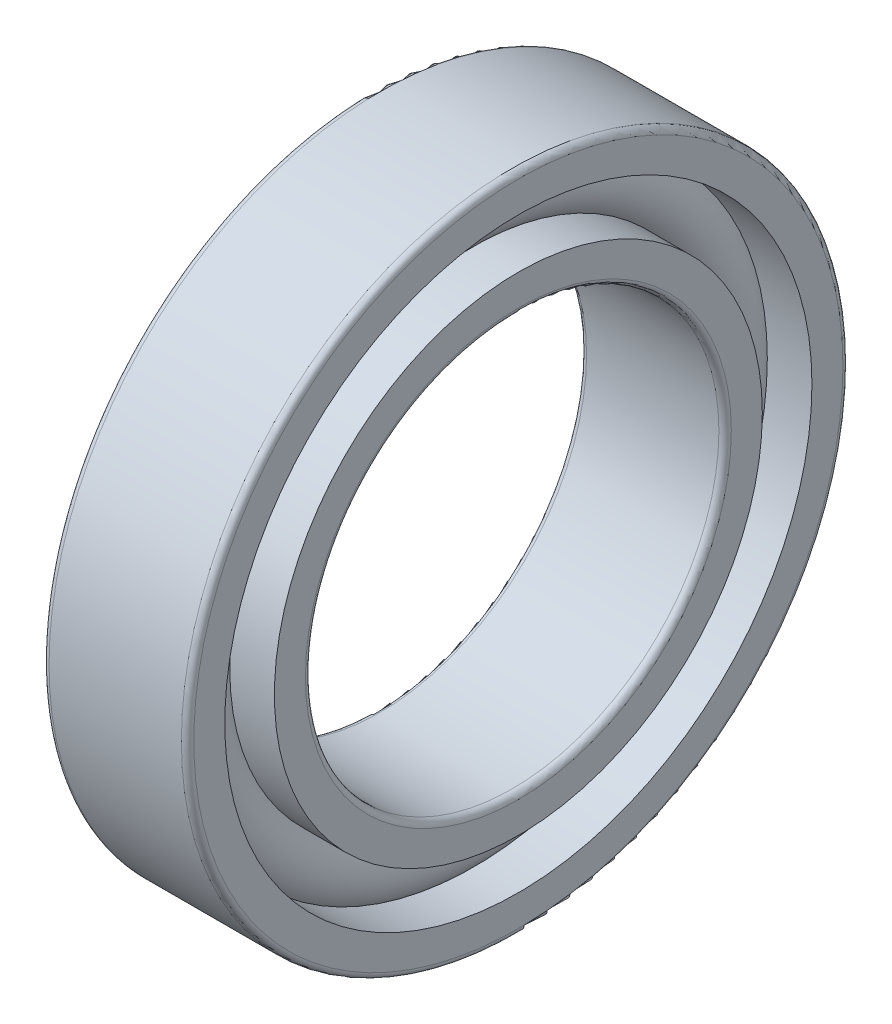
ISO-10303-21;
HEADER;
FILE_DESCRIPTION(('STEP AP214'),'2;1');
FILE_NAME('part.step','',(''),(''),'','','');
FILE_SCHEMA(('AUTOMOTIVE_DESIGN { 1 0 10303 214 1 1 1 1 }'));
ENDSEC;
DATA;
#1=APPLICATION_CONTEXT('core data for automotive mechanical design processes');
#2=APPLICATION_PROTOCOL_DEFINITION('international standard','automotive_design',2000,#1);
#3=PRODUCT_CONTEXT('',#1,'mechanical');
#4=PRODUCT('Part','Part','',(#3));
#5=PRODUCT_RELATED_PRODUCT_CATEGORY('part','',(#4));
#6=PRODUCT_DEFINITION_FORMATION('','',#4);
#7=PRODUCT_DEFINITION_CONTEXT('part definition',#1,'design');
#8=PRODUCT_DEFINITION('design','',#6,#7);
#9=PRODUCT_DEFINITION_SHAPE('','',#8);
#10=(LENGTH_UNIT() NAMED_UNIT(*) SI_UNIT(.MILLI.,.METRE.));
#11=(NAMED_UNIT(*) PLANE_ANGLE_UNIT() SI_UNIT($,.RADIAN.));
#12=(NAMED_UNIT(*) SI_UNIT($,.STERADIAN.) SOLID_ANGLE_UNIT());
#13=UNCERTAINTY_MEASURE_WITH_UNIT(LENGTH_MEASURE(1.E-05),#10,'distance_accuracy_value','');
#14=(GEOMETRIC_REPRESENTATION_CONTEXT(3) GLOBAL_UNCERTAINTY_ASSIGNED_CONTEXT((#13)) GLOBAL_UNIT_ASSIGNED_CONTEXT((#10,
#11,#12)) REPRESENTATION_CONTEXT('',''));
#15=CARTESIAN_POINT('',(0.,0.,0.));
#16=DIRECTION('',(0.,0.,1.));
#17=DIRECTION('',(1.,0.,0.));
#18=AXIS2_PLACEMENT_3D('',#15,#16,#17);
#19=CARTESIAN_POINT('',(0.,0.,0.));
#20=DIRECTION('',(-1.,0.,0.));
#21=DIRECTION('',(0.,0.,1.));
#22=AXIS2_PLACEMENT_3D('',#19,#20,#21);
#23=TOROIDAL_SURFACE('',#22,13.,1.8);
#24=CARTESIAN_POINT('',(1.34164078649987,0.,0.));
#25=DIRECTION('',(-1.,0.,0.));
#26=DIRECTION('',(0.,0.,1.));
#27=AXIS2_PLACEMENT_3D('',#24,#25,#26);
#28=CIRCLE('',#27,14.2);
#29=CARTESIAN_POINT('',(1.34164078649987,0.,14.2));
#30=VERTEX_POINT('',#29);
#31=EDGE_CURVE('E35',#30,#30,#28,.F.);
#32=ORIENTED_EDGE('',*,*,#31,.T.);
#33=EDGE_LOOP('',(#32));
#34=FACE_BOUND('',#33,.T.);
#35=CARTESIAN_POINT('',(1.34164078649987,0.,0.));
#36=DIRECTION('',(-1.,0.,0.));
#37=DIRECTION('',(0.,0.,1.));
#38=AXIS2_PLACEMENT_3D('',#35,#36,#37);
#39=CIRCLE('',#38,11.8);
#40=CARTESIAN_POINT('',(1.34164078649987,0.,11.8));
#41=VERTEX_POINT('',#40);
#42=EDGE_CURVE('E10',#41,#41,#39,.T.);
#43=ORIENTED_EDGE('',*,*,#42,.T.);
#44=EDGE_LOOP('',(#43));
#45=FACE_BOUND('',#44,.T.);
#46=ADVANCED_FACE('F31',(#34,#45),#23,.T.);
#47=CARTESIAN_POINT('',(-20.6375,0.,0.));
#48=DIRECTION('',(1.,0.,0.));
#49=DIRECTION('',(0.,0.,-1.));
#50=AXIS2_PLACEMENT_3D('',#47,#48,#49);
#51=CYLINDRICAL_SURFACE('',#50,11.8);
#52=CARTESIAN_POINT('',(3.5,0.,0.));
#53=DIRECTION('',(1.,0.,0.));
#54=DIRECTION('',(0.,0.,-1.));
#55=AXIS2_PLACEMENT_3D('',#52,#53,#54);
#56=CIRCLE('',#55,11.8);
#57=CARTESIAN_POINT('',(3.5,0.,-11.8));
#58=VERTEX_POINT('',#57);
#59=EDGE_CURVE('E44',#58,#58,#56,.T.);
#60=ORIENTED_EDGE('',*,*,#59,.F.);
#61=EDGE_LOOP('',(#60));
#62=FACE_BOUND('',#61,.T.);
#63=ORIENTED_EDGE('',*,*,#42,.F.);
#64=EDGE_LOOP('',(#63));
#65=FACE_BOUND('',#64,.T.);
#66=ADVANCED_FACE('F83',(#62,#65),#51,.T.);
#67=CARTESIAN_POINT('',(-20.6375,0.,0.));
#68=DIRECTION('',(1.,0.,0.));
#69=DIRECTION('',(0.,0.,-1.));
#70=AXIS2_PLACEMENT_3D('',#67,#68,#69);
#71=CYLINDRICAL_SURFACE('',#70,11.8);
#72=CARTESIAN_POINT('',(-3.5,0.,0.));
#73=DIRECTION('',(1.,0.,0.));
#74=DIRECTION('',(0.,0.,-1.));
#75=AXIS2_PLACEMENT_3D('',#72,#73,#74);
#76=CIRCLE('',#75,11.8);
#77=CARTESIAN_POINT('',(-3.5,0.,-11.8));
#78=VERTEX_POINT('',#77);
#79=EDGE_CURVE('E53',#78,#78,#76,.T.);
#80=ORIENTED_EDGE('',*,*,#79,.T.);
#81=EDGE_LOOP('',(#80));
#82=FACE_BOUND('',#81,.T.);
#83=CARTESIAN_POINT('',(-1.34164078649987,0.,0.));
#84=DIRECTION('',(1.,0.,0.));
#85=DIRECTION('',(0.,0.,-1.));
#86=AXIS2_PLACEMENT_3D('',#83,#84,#85);
#87=CIRCLE('',#86,11.8);
#88=CARTESIAN_POINT('',(-1.34164078649987,0.,-11.8));
#89=VERTEX_POINT('',#88);
#90=EDGE_CURVE('E39',#89,#89,#87,.T.);
#91=ORIENTED_EDGE('',*,*,#90,.F.);
#92=EDGE_LOOP('',(#91));
#93=FACE_BOUND('',#92,.T.);
#94=ADVANCED_FACE('F86',(#82,#93),#71,.T.);
#95=CARTESIAN_POINT('',(3.5,10.3,0.));
#96=DIRECTION('',(1.,0.,0.));
#97=DIRECTION('',(0.,0.,-1.));
#98=AXIS2_PLACEMENT_3D('',#95,#96,#97);
#99=PLANE('',#98);
#100=ORIENTED_EDGE('',*,*,#59,.T.);
#101=EDGE_LOOP('',(#100));
#102=FACE_BOUND('',#101,.T.);
#103=CARTESIAN_POINT('',(3.5,0.,0.));
#104=DIRECTION('',(1.,0.,0.));
#105=DIRECTION('',(0.,0.,-1.));
#106=AXIS2_PLACEMENT_3D('',#103,#104,#105);
#107=CIRCLE('',#106,10.3);
#108=CARTESIAN_POINT('',(3.5,0.,-10.3));
#109=VERTEX_POINT('',#108);
#110=EDGE_CURVE('E75',#109,#109,#107,.T.);
#111=ORIENTED_EDGE('',*,*,#110,.F.);
#112=EDGE_LOOP('',(#111));
#113=FACE_BOUND('',#112,.T.);
#114=ADVANCED_FACE('F80',(#102,#113),#99,.T.);
#115=CARTESIAN_POINT('',(3.2,0.,0.));
#116=DIRECTION('',(1.,0.,0.));
#117=DIRECTION('',(0.,0.,-1.));
#118=AXIS2_PLACEMENT_3D('',#115,#116,#117);
#119=TOROIDAL_SURFACE('',#118,10.3,0.300000000000002);
#120=ORIENTED_EDGE('',*,*,#110,.T.);
#121=EDGE_LOOP('',(#120));
#122=FACE_BOUND('',#121,.T.);
#123=CARTESIAN_POINT('',(3.2,0.,0.));
#124=DIRECTION('',(1.,0.,0.));
#125=DIRECTION('',(0.,0.,-1.));
#126=AXIS2_PLACEMENT_3D('',#123,#124,#125);
#127=CIRCLE('',#126,9.99999999999999);
#128=CARTESIAN_POINT('',(3.2,0.,-9.99999999999999));
#129=VERTEX_POINT('',#128);
#130=EDGE_CURVE('E72',#129,#129,#127,.T.);
#131=ORIENTED_EDGE('',*,*,#130,.F.);
#132=EDGE_LOOP('',(#131));
#133=FACE_BOUND('',#132,.T.);
#134=ADVANCED_FACE('F97',(#122,#133),#119,.T.);
#135=CARTESIAN_POINT('',(-20.6375,0.,0.));
#136=DIRECTION('',(1.,0.,0.));
#137=DIRECTION('',(0.,0.,-1.));
#138=AXIS2_PLACEMENT_3D('',#135,#136,#137);
#139=CYLINDRICAL_SURFACE('',#138,10.);
#140=ORIENTED_EDGE('',*,*,#130,.T.);
#141=EDGE_LOOP('',(#140));
#142=FACE_BOUND('',#141,.T.);
#143=CARTESIAN_POINT('',(-3.2,0.,0.));
#144=DIRECTION('',(1.,0.,0.));
#145=DIRECTION('',(0.,0.,-1.));
#146=AXIS2_PLACEMENT_3D('',#143,#144,#145);
#147=CIRCLE('',#146,10.);
#148=CARTESIAN_POINT('',(-3.2,0.,-10.));
#149=VERTEX_POINT('',#148);
#150=EDGE_CURVE('E69',#149,#149,#147,.T.);
#151=ORIENTED_EDGE('',*,*,#150,.F.);
#152=EDGE_LOOP('',(#151));
#153=FACE_BOUND('',#152,.T.);
#154=ADVANCED_FACE('F100',(#142,#153),#139,.F.);
#155=CARTESIAN_POINT('',(-3.2,0.,0.));
#156=DIRECTION('',(1.,0.,0.));
#157=DIRECTION('',(0.,0.,-1.));
#158=AXIS2_PLACEMENT_3D('',#155,#156,#157);
#159=TOROIDAL_SURFACE('',#158,10.3,0.300000000000002);
#160=ORIENTED_EDGE('',*,*,#150,.T.);
#161=EDGE_LOOP('',(#160));
#162=FACE_BOUND('',#161,.T.);
#163=CARTESIAN_POINT('',(-3.5,0.,0.));
#164=DIRECTION('',(1.,0.,0.));
#165=DIRECTION('',(0.,0.,-1.));
#166=AXIS2_PLACEMENT_3D('',#163,#164,#165);
#167=CIRCLE('',#166,10.3);
#168=CARTESIAN_POINT('',(-3.5,0.,-10.3));
#169=VERTEX_POINT('',#168);
#170=EDGE_CURVE('E66',#169,#169,#167,.T.);
#171=ORIENTED_EDGE('',*,*,#170,.F.);
#172=EDGE_LOOP('',(#171));
#173=FACE_BOUND('',#172,.T.);
#174=ADVANCED_FACE('F104',(#162,#173),#159,.T.);
#175=CARTESIAN_POINT('',(-3.5,11.8,0.));
#176=DIRECTION('',(-1.,0.,0.));
#177=DIRECTION('',(0.,0.,1.));
#178=AXIS2_PLACEMENT_3D('',#175,#176,#177);
#179=PLANE('',#178);
#180=ORIENTED_EDGE('',*,*,#170,.T.);
#181=EDGE_LOOP('',(#180));
#182=FACE_BOUND('',#181,.T.);
#183=ORIENTED_EDGE('',*,*,#79,.F.);
#184=EDGE_LOOP('',(#183));
#185=FACE_BOUND('',#184,.T.);
#186=ADVANCED_FACE('F108',(#182,#185),#179,.T.);
#187=CARTESIAN_POINT('',(-1.34164078649987,0.,0.));
#188=DIRECTION('',(1.,0.,0.));
#189=DIRECTION('',(0.,0.,-1.));
#190=AXIS2_PLACEMENT_3D('',#187,#188,#189);
#191=CIRCLE('',#190,14.2);
#192=CARTESIAN_POINT('',(-1.34164078649987,0.,-14.2));
#193=VERTEX_POINT('',#192);
#194=EDGE_CURVE('E47',#193,#193,#191,.F.);
#195=ORIENTED_EDGE('',*,*,#194,.T.);
#196=EDGE_LOOP('',(#195));
#197=FACE_BOUND('',#196,.T.);
#198=ORIENTED_EDGE('',*,*,#90,.T.);
#199=EDGE_LOOP('',(#198));
#200=FACE_BOUND('',#199,.T.);
#201=ADVANCED_FACE('F33',(#197,#200),#23,.T.);
#202=CARTESIAN_POINT('',(-20.6375,0.,0.));
#203=DIRECTION('',(1.,0.,0.));
#204=DIRECTION('',(0.,0.,-1.));
#205=AXIS2_PLACEMENT_3D('',#202,#203,#204);
#206=CYLINDRICAL_SURFACE('',#205,14.2);
#207=CARTESIAN_POINT('',(3.5,0.,0.));
#208=DIRECTION('',(1.,0.,0.));
#209=DIRECTION('',(0.,0.,-1.));
#210=AXIS2_PLACEMENT_3D('',#207,#208,#209);
#211=CIRCLE('',#210,14.2);
#212=CARTESIAN_POINT('',(3.5,0.,-14.2));
#213=VERTEX_POINT('',#212);
#214=EDGE_CURVE('E49',#213,#213,#211,.T.);
#215=ORIENTED_EDGE('',*,*,#214,.T.);
#216=EDGE_LOOP('',(#215));
#217=FACE_BOUND('',#216,.T.);
#218=ORIENTED_EDGE('',*,*,#31,.F.);
#219=EDGE_LOOP('',(#218));
#220=FACE_BOUND('',#219,.T.);
#221=ADVANCED_FACE('F113',(#217,#220),#206,.F.);
#222=CARTESIAN_POINT('',(-20.6375,0.,0.));
#223=DIRECTION('',(1.,0.,0.));
#224=DIRECTION('',(0.,0.,-1.));
#225=AXIS2_PLACEMENT_3D('',#222,#223,#224);
#226=CYLINDRICAL_SURFACE('',#225,14.2);
#227=CARTESIAN_POINT('',(-3.5,0.,0.));
#228=DIRECTION('',(1.,0.,0.));
#229=DIRECTION('',(0.,0.,-1.));
#230=AXIS2_PLACEMENT_3D('',#227,#228,#229);
#231=CIRCLE('',#230,14.2);
#232=CARTESIAN_POINT('',(-3.5,0.,-14.2));
#233=VERTEX_POINT('',#232);
#234=EDGE_CURVE('E144',#233,#233,#231,.T.);
#235=ORIENTED_EDGE('',*,*,#234,.F.);
#236=EDGE_LOOP('',(#235));
#237=FACE_BOUND('',#236,.T.);
#238=ORIENTED_EDGE('',*,*,#194,.F.);
#239=EDGE_LOOP('',(#238));
#240=FACE_BOUND('',#239,.T.);
#241=ADVANCED_FACE('F116',(#237,#240),#226,.F.);
#242=CARTESIAN_POINT('',(3.5,15.7,0.));
#243=DIRECTION('',(1.,0.,0.));
#244=DIRECTION('',(0.,0.,-1.));
#245=AXIS2_PLACEMENT_3D('',#242,#243,#244);
#246=PLANE('',#245);
#247=CARTESIAN_POINT('',(3.5,0.,0.));
#248=DIRECTION('',(1.,0.,0.));
#249=DIRECTION('',(0.,0.,-1.));
#250=AXIS2_PLACEMENT_3D('',#247,#248,#249);
#251=CIRCLE('',#250,15.7);
#252=CARTESIAN_POINT('',(3.5,0.,-15.7));
#253=VERTEX_POINT('',#252);
#254=EDGE_CURVE('E55',#253,#253,#251,.T.);
#255=ORIENTED_EDGE('',*,*,#254,.T.);
#256=EDGE_LOOP('',(#255));
#257=FACE_BOUND('',#256,.T.);
#258=ORIENTED_EDGE('',*,*,#214,.F.);
#259=EDGE_LOOP('',(#258));
#260=FACE_BOUND('',#259,.T.);
#261=ADVANCED_FACE('F117',(#257,#260),#246,.T.);
#262=CARTESIAN_POINT('',(3.2,0.,0.));
#263=DIRECTION('',(1.,0.,0.));
#264=DIRECTION('',(0.,0.,-1.));
#265=AXIS2_PLACEMENT_3D('',#262,#263,#264);
#266=TOROIDAL_SURFACE('',#265,15.7,0.300000000000001);
#267=CARTESIAN_POINT('',(3.2,0.,0.));
#268=DIRECTION('',(1.,0.,0.));
#269=DIRECTION('',(0.,0.,-1.));
#270=AXIS2_PLACEMENT_3D('',#267,#268,#269);
#271=CIRCLE('',#270,16.);
#272=CARTESIAN_POINT('',(3.2,0.,-16.));
#273=VERTEX_POINT('',#272);
#274=EDGE_CURVE('E60',#273,#273,#271,.T.);
#275=ORIENTED_EDGE('',*,*,#274,.T.);
#276=EDGE_LOOP('',(#275));
#277=FACE_BOUND('',#276,.T.);
#278=ORIENTED_EDGE('',*,*,#254,.F.);
#279=EDGE_LOOP('',(#278));
#280=FACE_BOUND('',#279,.T.);
#281=ADVANCED_FACE('F120',(#277,#280),#266,.T.);
#282=CARTESIAN_POINT('',(-20.6375,0.,0.));
#283=DIRECTION('',(1.,0.,0.));
#284=DIRECTION('',(0.,0.,-1.));
#285=AXIS2_PLACEMENT_3D('',#282,#283,#284);
#286=CYLINDRICAL_SURFACE('',#285,16.);
#287=CARTESIAN_POINT('',(-3.2,0.,0.));
#288=DIRECTION('',(1.,0.,0.));
#289=DIRECTION('',(0.,0.,-1.));
#290=AXIS2_PLACEMENT_3D('',#287,#288,#289);
#291=CIRCLE('',#290,16.);
#292=CARTESIAN_POINT('',(-3.2,0.,-16.));
#293=VERTEX_POINT('',#292);
#294=EDGE_CURVE('E148',#293,#293,#291,.T.);
#295=ORIENTED_EDGE('',*,*,#294,.T.);
#296=EDGE_LOOP('',(#295));
#297=FACE_BOUND('',#296,.T.);
#298=ORIENTED_EDGE('',*,*,#274,.F.);
#299=EDGE_LOOP('',(#298));
#300=FACE_BOUND('',#299,.T.);
#301=ADVANCED_FACE('F124',(#297,#300),#286,.T.);
#302=CARTESIAN_POINT('',(-3.2,0.,0.));
#303=DIRECTION('',(1.,0.,0.));
#304=DIRECTION('',(0.,0.,-1.));
#305=AXIS2_PLACEMENT_3D('',#302,#303,#304);
#306=TOROIDAL_SURFACE('',#305,15.7,0.300000000000001);
#307=CARTESIAN_POINT('',(-3.5,0.,0.));
#308=DIRECTION('',(1.,0.,0.));
#309=DIRECTION('',(0.,0.,-1.));
#310=AXIS2_PLACEMENT_3D('',#307,#308,#309);
#311=CIRCLE('',#310,15.7);
#312=CARTESIAN_POINT('',(-3.5,0.,-15.7));
#313=VERTEX_POINT('',#312);
#314=EDGE_CURVE('E145',#313,#313,#311,.T.);
#315=ORIENTED_EDGE('',*,*,#314,.T.);
#316=EDGE_LOOP('',(#315));
#317=FACE_BOUND('',#316,.T.);
#318=ORIENTED_EDGE('',*,*,#294,.F.);
#319=EDGE_LOOP('',(#318));
#320=FACE_BOUND('',#319,.T.);
#321=ADVANCED_FACE('F128',(#317,#320),#306,.T.);
#322=CARTESIAN_POINT('',(-3.5,14.2,0.));
#323=DIRECTION('',(-1.,0.,0.));
#324=DIRECTION('',(0.,0.,1.));
#325=AXIS2_PLACEMENT_3D('',#322,#323,#324);
#326=PLANE('',#325);
#327=ORIENTED_EDGE('',*,*,#234,.T.);
#328=EDGE_LOOP('',(#327));
#329=FACE_BOUND('',#328,.T.);
#330=ORIENTED_EDGE('',*,*,#314,.F.);
#331=EDGE_LOOP('',(#330));
#332=FACE_BOUND('',#331,.T.);
#333=ADVANCED_FACE('F132',(#329,#332),#326,.T.);
#334=CLOSED_SHELL('',(#46,#66,#94,#114,#134,#154,#174,#186,#201,#221,#241,#261,#281,#301,#321,#333));
#335=MANIFOLD_SOLID_BREP('B2',#334);
#336=ADVANCED_BREP_SHAPE_REPRESENTATION('',(#18,#335),#14);
#337=SHAPE_DEFINITION_REPRESENTATION(#9,#336);
ENDSEC;
END-ISO-10303-21;
